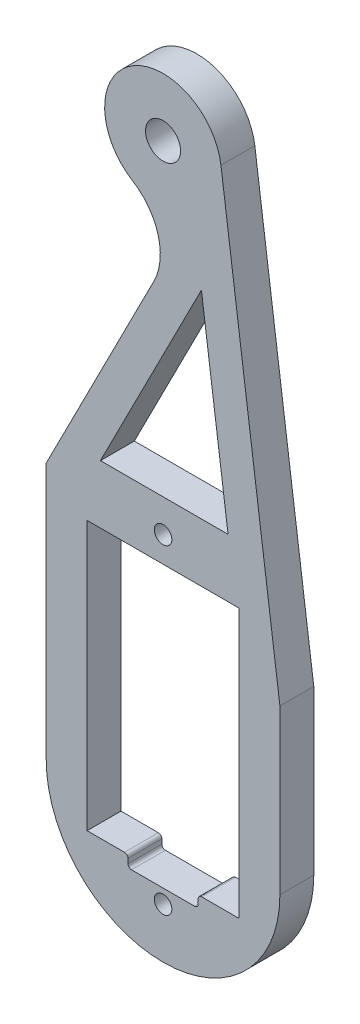
ISO-10303-21;
HEADER;
FILE_DESCRIPTION(('STEP AP214'),'2;1');
FILE_NAME('part.step','',(''),(''),'','','');
FILE_SCHEMA(('AUTOMOTIVE_DESIGN { 1 0 10303 214 1 1 1 1 }'));
ENDSEC;
DATA;
#1=APPLICATION_CONTEXT('core data for automotive mechanical design processes');
#2=APPLICATION_PROTOCOL_DEFINITION('international standard','automotive_design',2000,#1);
#3=PRODUCT_CONTEXT('',#1,'mechanical');
#4=PRODUCT('Part','Part','',(#3));
#5=PRODUCT_RELATED_PRODUCT_CATEGORY('part','',(#4));
#6=PRODUCT_DEFINITION_FORMATION('','',#4);
#7=PRODUCT_DEFINITION_CONTEXT('part definition',#1,'design');
#8=PRODUCT_DEFINITION('design','',#6,#7);
#9=PRODUCT_DEFINITION_SHAPE('','',#8);
#10=(LENGTH_UNIT() NAMED_UNIT(*) SI_UNIT(.MILLI.,.METRE.));
#11=(NAMED_UNIT(*) PLANE_ANGLE_UNIT() SI_UNIT($,.RADIAN.));
#12=(NAMED_UNIT(*) SI_UNIT($,.STERADIAN.) SOLID_ANGLE_UNIT());
#13=UNCERTAINTY_MEASURE_WITH_UNIT(LENGTH_MEASURE(1.E-05),#10,'distance_accuracy_value','');
#14=(GEOMETRIC_REPRESENTATION_CONTEXT(3) GLOBAL_UNCERTAINTY_ASSIGNED_CONTEXT((#13)) GLOBAL_UNIT_ASSIGNED_CONTEXT((#10,
#11,#12)) REPRESENTATION_CONTEXT('',''));
#15=CARTESIAN_POINT('',(0.,0.,0.));
#16=DIRECTION('',(0.,0.,1.));
#17=DIRECTION('',(1.,0.,0.));
#18=AXIS2_PLACEMENT_3D('',#15,#16,#17);
#19=CARTESIAN_POINT('',(0.,-11.5,1.45));
#20=DIRECTION('',(0.,1.,0.));
#21=DIRECTION('',(0.,0.,1.));
#22=AXIS2_PLACEMENT_3D('',#19,#20,#21);
#23=PLANE('',#22);
#24=DIRECTION('',(1.,0.,0.));
#25=VECTOR('',#24,1.);
#26=CARTESIAN_POINT('',(0.,-11.5,-1.45));
#27=LINE('',#26,#25);
#28=CARTESIAN_POINT('',(3.3,-11.5,-1.45));
#29=VERTEX_POINT('',#28);
#30=CARTESIAN_POINT('',(6.5,-11.5,-1.45));
#31=VERTEX_POINT('',#30);
#32=EDGE_CURVE('E282',#29,#31,#27,.T.);
#33=ORIENTED_EDGE('',*,*,#32,.F.);
#34=DIRECTION('',(0.,0.,1.));
#35=VECTOR('',#34,1.);
#36=CARTESIAN_POINT('',(3.3,-11.5,1.45));
#37=LINE('',#36,#35);
#38=CARTESIAN_POINT('',(3.3,-11.5,1.45));
#39=VERTEX_POINT('',#38);
#40=EDGE_CURVE('E349',#29,#39,#37,.T.);
#41=ORIENTED_EDGE('',*,*,#40,.T.);
#42=DIRECTION('',(1.,0.,0.));
#43=VECTOR('',#42,1.);
#44=CARTESIAN_POINT('',(0.,-11.5,1.45));
#45=LINE('',#44,#43);
#46=CARTESIAN_POINT('',(6.5,-11.5,1.45));
#47=VERTEX_POINT('',#46);
#48=EDGE_CURVE('E232',#39,#47,#45,.T.);
#49=ORIENTED_EDGE('',*,*,#48,.T.);
#50=DIRECTION('',(0.,0.,-1.));
#51=VECTOR('',#50,1.);
#52=CARTESIAN_POINT('',(6.5,-11.5,1.45));
#53=LINE('',#52,#51);
#54=EDGE_CURVE('E314',#47,#31,#53,.T.);
#55=ORIENTED_EDGE('',*,*,#54,.T.);
#56=EDGE_LOOP('',(#33,#41,#49,#55));
#57=FACE_BOUND('',#56,.T.);
#58=ADVANCED_FACE('F36',(#57),#23,.T.);
#59=CARTESIAN_POINT('',(0.,16.5,1.45));
#60=DIRECTION('',(0.,1.,0.));
#61=DIRECTION('',(0.,0.,1.));
#62=AXIS2_PLACEMENT_3D('',#59,#60,#61);
#63=PLANE('',#62);
#64=DIRECTION('',(1.,0.,0.));
#65=VECTOR('',#64,1.);
#66=CARTESIAN_POINT('',(0.,16.5,-1.45));
#67=LINE('',#66,#65);
#68=CARTESIAN_POINT('',(-5.35920766336086,16.5,-1.45));
#69=VERTEX_POINT('',#68);
#70=CARTESIAN_POINT('',(5.56229891618006,16.5,-1.45));
#71=VERTEX_POINT('',#70);
#72=EDGE_CURVE('E288',#69,#71,#67,.T.);
#73=ORIENTED_EDGE('',*,*,#72,.F.);
#74=DIRECTION('',(0.,0.,-1.));
#75=VECTOR('',#74,1.);
#76=CARTESIAN_POINT('',(-5.35920766336086,16.5,1.45));
#77=LINE('',#76,#75);
#78=CARTESIAN_POINT('',(-5.35920766336086,16.5,1.45));
#79=VERTEX_POINT('',#78);
#80=EDGE_CURVE('E308',#79,#69,#77,.T.);
#81=ORIENTED_EDGE('',*,*,#80,.F.);
#82=DIRECTION('',(1.,0.,0.));
#83=VECTOR('',#82,1.);
#84=CARTESIAN_POINT('',(0.,16.5,1.45));
#85=LINE('',#84,#83);
#86=CARTESIAN_POINT('',(5.56229891618006,16.5,1.45));
#87=VERTEX_POINT('',#86);
#88=EDGE_CURVE('E239',#79,#87,#85,.T.);
#89=ORIENTED_EDGE('',*,*,#88,.T.);
#90=DIRECTION('',(0.,0.,-1.));
#91=VECTOR('',#90,1.);
#92=CARTESIAN_POINT('',(5.56229891618006,16.5,1.45));
#93=LINE('',#92,#91);
#94=EDGE_CURVE('E303',#87,#71,#93,.T.);
#95=ORIENTED_EDGE('',*,*,#94,.T.);
#96=EDGE_LOOP('',(#73,#81,#89,#95));
#97=FACE_BOUND('',#96,.T.);
#98=ADVANCED_FACE('F431',(#97),#63,.T.);
#99=CARTESIAN_POINT('',(-10.9290256495219,5.56861670660875,1.45));
#100=DIRECTION('',(-0.891006524188369,0.453990499739544,0.));
#101=DIRECTION('',(-0.453990499739545,-0.891006524188369,0.));
#102=AXIS2_PLACEMENT_3D('',#99,#100,#101);
#103=PLANE('',#102);
#104=DIRECTION('',(0.453990499739544,0.891006524188369,0.));
#105=VECTOR('',#104,1.);
#106=CARTESIAN_POINT('',(-10.9290256495219,5.56861670660875,-1.45));
#107=LINE('',#106,#105);
#108=CARTESIAN_POINT('',(3.28334616685816,33.4619669415817,-1.45));
#109=VERTEX_POINT('',#108);
#110=EDGE_CURVE('E291',#69,#109,#107,.T.);
#111=ORIENTED_EDGE('',*,*,#110,.T.);
#112=DIRECTION('',(0.,0.,-1.));
#113=VECTOR('',#112,1.);
#114=CARTESIAN_POINT('',(3.28334616685816,33.4619669415817,1.45));
#115=LINE('',#114,#113);
#116=CARTESIAN_POINT('',(3.28334616685816,33.4619669415817,1.45));
#117=VERTEX_POINT('',#116);
#118=EDGE_CURVE('E305',#117,#109,#115,.T.);
#119=ORIENTED_EDGE('',*,*,#118,.F.);
#120=DIRECTION('',(0.453990499739544,0.891006524188369,0.));
#121=VECTOR('',#120,1.);
#122=CARTESIAN_POINT('',(-10.9290256495219,5.56861670660875,1.45));
#123=LINE('',#122,#121);
#124=EDGE_CURVE('E242',#79,#117,#123,.T.);
#125=ORIENTED_EDGE('',*,*,#124,.F.);
#126=ORIENTED_EDGE('',*,*,#80,.T.);
#127=EDGE_LOOP('',(#111,#119,#125,#126));
#128=FACE_BOUND('',#127,.T.);
#129=ADVANCED_FACE('F424',(#128),#103,.F.);
#130=CARTESIAN_POINT('',(0.,11.5,1.45));
#131=DIRECTION('',(0.,1.,0.));
#132=DIRECTION('',(0.,0.,1.));
#133=AXIS2_PLACEMENT_3D('',#130,#131,#132);
#134=PLANE('',#133);
#135=DIRECTION('',(1.,0.,0.));
#136=VECTOR('',#135,1.);
#137=CARTESIAN_POINT('',(0.,11.5,-1.45));
#138=LINE('',#137,#136);
#139=CARTESIAN_POINT('',(-6.5,11.5,-1.45));
#140=VERTEX_POINT('',#139);
#141=CARTESIAN_POINT('',(6.5,11.5,-1.45));
#142=VERTEX_POINT('',#141);
#143=EDGE_CURVE('E276',#140,#142,#138,.T.);
#144=ORIENTED_EDGE('',*,*,#143,.T.);
#145=DIRECTION('',(0.,0.,-1.));
#146=VECTOR('',#145,1.);
#147=CARTESIAN_POINT('',(6.5,11.5,1.45));
#148=LINE('',#147,#146);
#149=CARTESIAN_POINT('',(6.5,11.5,1.45));
#150=VERTEX_POINT('',#149);
#151=EDGE_CURVE('E306',#150,#142,#148,.T.);
#152=ORIENTED_EDGE('',*,*,#151,.F.);
#153=DIRECTION('',(1.,0.,0.));
#154=VECTOR('',#153,1.);
#155=CARTESIAN_POINT('',(0.,11.5,1.45));
#156=LINE('',#155,#154);
#157=CARTESIAN_POINT('',(-6.5,11.5,1.45));
#158=VERTEX_POINT('',#157);
#159=EDGE_CURVE('E226',#158,#150,#156,.T.);
#160=ORIENTED_EDGE('',*,*,#159,.F.);
#161=DIRECTION('',(0.,0.,-1.));
#162=VECTOR('',#161,1.);
#163=CARTESIAN_POINT('',(-6.5,11.5,1.45));
#164=LINE('',#163,#162);
#165=EDGE_CURVE('E196',#158,#140,#164,.T.);
#166=ORIENTED_EDGE('',*,*,#165,.T.);
#167=EDGE_LOOP('',(#144,#152,#160,#166));
#168=FACE_BOUND('',#167,.T.);
#169=ADVANCED_FACE('F422',(#168),#134,.F.);
#170=CARTESIAN_POINT('',(6.5,0.,1.45));
#171=DIRECTION('',(1.,0.,0.));
#172=DIRECTION('',(0.,1.,0.));
#173=AXIS2_PLACEMENT_3D('',#170,#171,#172);
#174=PLANE('',#173);
#175=DIRECTION('',(0.,-1.,0.));
#176=VECTOR('',#175,1.);
#177=CARTESIAN_POINT('',(6.5,0.,-1.45));
#178=LINE('',#177,#176);
#179=EDGE_CURVE('E279',#142,#31,#178,.T.);
#180=ORIENTED_EDGE('',*,*,#179,.T.);
#181=ORIENTED_EDGE('',*,*,#54,.F.);
#182=DIRECTION('',(0.,-1.,0.));
#183=VECTOR('',#182,1.);
#184=CARTESIAN_POINT('',(6.5,0.,1.45));
#185=LINE('',#184,#183);
#186=EDGE_CURVE('E229',#150,#47,#185,.T.);
#187=ORIENTED_EDGE('',*,*,#186,.F.);
#188=ORIENTED_EDGE('',*,*,#151,.T.);
#189=EDGE_LOOP('',(#180,#181,#187,#188));
#190=FACE_BOUND('',#189,.T.);
#191=ADVANCED_FACE('F407',(#190),#174,.F.);
#192=CARTESIAN_POINT('',(-6.5,-11.5,1.45));
#193=VERTEX_POINT('',#192);
#194=CARTESIAN_POINT('',(-3.3,-11.5,1.45));
#195=VERTEX_POINT('',#194);
#196=EDGE_CURVE('E233',#193,#195,#45,.T.);
#197=ORIENTED_EDGE('',*,*,#196,.T.);
#198=DIRECTION('',(0.,0.,1.));
#199=VECTOR('',#198,1.);
#200=CARTESIAN_POINT('',(-3.3,-11.5,-1.45));
#201=LINE('',#200,#199);
#202=CARTESIAN_POINT('',(-3.3,-11.5,-1.45));
#203=VERTEX_POINT('',#202);
#204=EDGE_CURVE('E363',#195,#203,#201,.F.);
#205=ORIENTED_EDGE('',*,*,#204,.T.);
#206=CARTESIAN_POINT('',(-6.5,-11.5,-1.45));
#207=VERTEX_POINT('',#206);
#208=EDGE_CURVE('E283',#207,#203,#27,.T.);
#209=ORIENTED_EDGE('',*,*,#208,.F.);
#210=DIRECTION('',(0.,0.,-1.));
#211=VECTOR('',#210,1.);
#212=CARTESIAN_POINT('',(-6.5,-11.5,1.45));
#213=LINE('',#212,#211);
#214=EDGE_CURVE('E312',#193,#207,#213,.T.);
#215=ORIENTED_EDGE('',*,*,#214,.F.);
#216=EDGE_LOOP('',(#197,#205,#209,#215));
#217=FACE_BOUND('',#216,.T.);
#218=ADVANCED_FACE('F419',(#217),#23,.T.);
#219=CARTESIAN_POINT('',(-5.23715044284418,34.361064899941,1.45));
#220=DIRECTION('',(0.,0.,-1.));
#221=DIRECTION('',(-1.,0.,0.));
#222=AXIS2_PLACEMENT_3D('',#219,#220,#221);
#223=CYLINDRICAL_SURFACE('',#222,5.);
#224=CARTESIAN_POINT('',(-5.23715044284418,34.361064899941,-1.45));
#225=DIRECTION('',(0.,0.,1.));
#226=DIRECTION('',(1.,0.,0.));
#227=AXIS2_PLACEMENT_3D('',#224,#225,#226);
#228=CIRCLE('',#227,5.);
#229=CARTESIAN_POINT('',(-0.78211782190234,32.0911124012433,-1.45));
#230=VERTEX_POINT('',#229);
#231=CARTESIAN_POINT('',(-2.61857522142209,38.6205324499705,-1.45));
#232=VERTEX_POINT('',#231);
#233=EDGE_CURVE('E191',#230,#232,#228,.T.);
#234=ORIENTED_EDGE('',*,*,#233,.F.);
#235=DIRECTION('',(0.,0.,-1.));
#236=VECTOR('',#235,1.);
#237=CARTESIAN_POINT('',(-0.78211782190234,32.0911124012433,1.45));
#238=LINE('',#237,#236);
#239=CARTESIAN_POINT('',(-0.78211782190234,32.0911124012433,1.45));
#240=VERTEX_POINT('',#239);
#241=EDGE_CURVE('E186',#240,#230,#238,.T.);
#242=ORIENTED_EDGE('',*,*,#241,.F.);
#243=CARTESIAN_POINT('',(-5.23715044284418,34.361064899941,1.45));
#244=DIRECTION('',(0.,0.,1.));
#245=DIRECTION('',(1.,0.,0.));
#246=AXIS2_PLACEMENT_3D('',#243,#244,#245);
#247=CIRCLE('',#246,5.);
#248=CARTESIAN_POINT('',(-2.61857522142209,38.6205324499705,1.45));
#249=VERTEX_POINT('',#248);
#250=EDGE_CURVE('E189',#240,#249,#247,.T.);
#251=ORIENTED_EDGE('',*,*,#250,.T.);
#252=DIRECTION('',(0.,0.,-1.));
#253=VECTOR('',#252,1.);
#254=CARTESIAN_POINT('',(-2.61857522142209,38.6205324499705,1.45));
#255=LINE('',#254,#253);
#256=EDGE_CURVE('E253',#249,#232,#255,.T.);
#257=ORIENTED_EDGE('',*,*,#256,.T.);
#258=EDGE_LOOP('',(#234,#242,#251,#257));
#259=FACE_BOUND('',#258,.T.);
#260=ADVANCED_FACE('F188',(#259),#223,.F.);
#261=CARTESIAN_POINT('',(-13.602045222087,6.93058820582737,1.45));
#262=DIRECTION('',(-0.891006524188369,0.453990499739544,0.));
#263=DIRECTION('',(-0.453990499739544,-0.891006524188369,0.));
#264=AXIS2_PLACEMENT_3D('',#261,#262,#263);
#265=PLANE('',#264);
#266=DIRECTION('',(0.453990499739544,0.891006524188369,0.));
#267=VECTOR('',#266,1.);
#268=CARTESIAN_POINT('',(-13.602045222087,6.93058820582737,-1.45));
#269=LINE('',#268,#267);
#270=CARTESIAN_POINT('',(-10.,14.,-1.45));
#271=VERTEX_POINT('',#270);
#272=EDGE_CURVE('E259',#271,#230,#269,.T.);
#273=ORIENTED_EDGE('',*,*,#272,.F.);
#274=DIRECTION('',(0.,0.,-1.));
#275=VECTOR('',#274,1.);
#276=CARTESIAN_POINT('',(-10.,14.,1.45));
#277=LINE('',#276,#275);
#278=CARTESIAN_POINT('',(-10.,14.,1.45));
#279=VERTEX_POINT('',#278);
#280=EDGE_CURVE('E197',#279,#271,#277,.T.);
#281=ORIENTED_EDGE('',*,*,#280,.F.);
#282=DIRECTION('',(0.453990499739544,0.891006524188369,0.));
#283=VECTOR('',#282,1.);
#284=CARTESIAN_POINT('',(-13.602045222087,6.93058820582737,1.45));
#285=LINE('',#284,#283);
#286=EDGE_CURVE('E204',#279,#240,#285,.T.);
#287=ORIENTED_EDGE('',*,*,#286,.T.);
#288=ORIENTED_EDGE('',*,*,#241,.T.);
#289=EDGE_LOOP('',(#273,#281,#287,#288));
#290=FACE_BOUND('',#289,.T.);
#291=ADVANCED_FACE('F211',(#290),#265,.T.);
#292=CARTESIAN_POINT('',(-10.,0.,1.45));
#293=DIRECTION('',(-1.,0.,0.));
#294=DIRECTION('',(0.,-1.,0.));
#295=AXIS2_PLACEMENT_3D('',#292,#293,#294);
#296=PLANE('',#295);
#297=DIRECTION('',(0.,1.,0.));
#298=VECTOR('',#297,1.);
#299=CARTESIAN_POINT('',(-10.,0.,-1.45));
#300=LINE('',#299,#298);
#301=CARTESIAN_POINT('',(-10.,-8.,-1.45));
#302=VERTEX_POINT('',#301);
#303=EDGE_CURVE('E261',#302,#271,#300,.T.);
#304=ORIENTED_EDGE('',*,*,#303,.F.);
#305=DIRECTION('',(0.,0.,-1.));
#306=VECTOR('',#305,1.);
#307=CARTESIAN_POINT('',(-10.,-8.,1.45));
#308=LINE('',#307,#306);
#309=CARTESIAN_POINT('',(-10.,-8.,1.45));
#310=VERTEX_POINT('',#309);
#311=EDGE_CURVE('E329',#310,#302,#308,.T.);
#312=ORIENTED_EDGE('',*,*,#311,.F.);
#313=DIRECTION('',(0.,1.,0.));
#314=VECTOR('',#313,1.);
#315=CARTESIAN_POINT('',(-10.,0.,1.45));
#316=LINE('',#315,#314);
#317=EDGE_CURVE('E212',#310,#279,#316,.T.);
#318=ORIENTED_EDGE('',*,*,#317,.T.);
#319=ORIENTED_EDGE('',*,*,#280,.T.);
#320=EDGE_LOOP('',(#304,#312,#318,#319));
#321=FACE_BOUND('',#320,.T.);
#322=ADVANCED_FACE('F451',(#321),#296,.T.);
#323=CARTESIAN_POINT('',(0.,-8.,1.45));
#324=DIRECTION('',(0.,0.,-1.));
#325=DIRECTION('',(-1.,0.,0.));
#326=AXIS2_PLACEMENT_3D('',#323,#324,#325);
#327=CYLINDRICAL_SURFACE('',#326,10.);
#328=CARTESIAN_POINT('',(0.,-8.,-1.45));
#329=DIRECTION('',(0.,0.,1.));
#330=DIRECTION('',(1.,0.,0.));
#331=AXIS2_PLACEMENT_3D('',#328,#329,#330);
#332=CIRCLE('',#331,10.);
#333=CARTESIAN_POINT('',(10.,-8.,-1.45));
#334=VERTEX_POINT('',#333);
#335=EDGE_CURVE('E264',#302,#334,#332,.T.);
#336=ORIENTED_EDGE('',*,*,#335,.T.);
#337=DIRECTION('',(0.,0.,-1.));
#338=VECTOR('',#337,1.);
#339=CARTESIAN_POINT('',(10.,-8.,1.45));
#340=LINE('',#339,#338);
#341=CARTESIAN_POINT('',(10.,-8.,1.45));
#342=VERTEX_POINT('',#341);
#343=EDGE_CURVE('E326',#342,#334,#340,.T.);
#344=ORIENTED_EDGE('',*,*,#343,.F.);
#345=CARTESIAN_POINT('',(0.,-8.,1.45));
#346=DIRECTION('',(0.,0.,1.));
#347=DIRECTION('',(1.,0.,0.));
#348=AXIS2_PLACEMENT_3D('',#345,#346,#347);
#349=CIRCLE('',#348,10.);
#350=EDGE_CURVE('E214',#310,#342,#349,.T.);
#351=ORIENTED_EDGE('',*,*,#350,.F.);
#352=ORIENTED_EDGE('',*,*,#311,.T.);
#353=EDGE_LOOP('',(#336,#344,#351,#352));
#354=FACE_BOUND('',#353,.T.);
#355=ADVANCED_FACE('F607',(#354),#327,.T.);
#356=CARTESIAN_POINT('',(10.,0.,1.45));
#357=DIRECTION('',(-1.,0.,0.));
#358=DIRECTION('',(0.,-1.,0.));
#359=AXIS2_PLACEMENT_3D('',#356,#357,#358);
#360=PLANE('',#359);
#361=DIRECTION('',(0.,1.,0.));
#362=VECTOR('',#361,1.);
#363=CARTESIAN_POINT('',(10.,0.,-1.45));
#364=LINE('',#363,#362);
#365=CARTESIAN_POINT('',(10.,6.,-1.45));
#366=VERTEX_POINT('',#365);
#367=EDGE_CURVE('E267',#334,#366,#364,.T.);
#368=ORIENTED_EDGE('',*,*,#367,.T.);
#369=DIRECTION('',(0.,0.,-1.));
#370=VECTOR('',#369,1.);
#371=CARTESIAN_POINT('',(10.,6.,1.45));
#372=LINE('',#371,#370);
#373=CARTESIAN_POINT('',(10.,6.,1.45));
#374=VERTEX_POINT('',#373);
#375=EDGE_CURVE('E323',#374,#366,#372,.T.);
#376=ORIENTED_EDGE('',*,*,#375,.F.);
#377=DIRECTION('',(0.,1.,0.));
#378=VECTOR('',#377,1.);
#379=CARTESIAN_POINT('',(10.,0.,1.45));
#380=LINE('',#379,#378);
#381=EDGE_CURVE('E220',#342,#374,#380,.T.);
#382=ORIENTED_EDGE('',*,*,#381,.F.);
#383=ORIENTED_EDGE('',*,*,#343,.T.);
#384=EDGE_LOOP('',(#368,#376,#382,#383));
#385=FACE_BOUND('',#384,.T.);
#386=ADVANCED_FACE('F597',(#385),#360,.F.);
#387=CARTESIAN_POINT('',(10.6145294422461,1.42613242547147,1.45));
#388=DIRECTION('',(-0.991094537062106,-0.133160123932241,0.));
#389=DIRECTION('',(0.133160123932241,-0.991094537062106,0.));
#390=AXIS2_PLACEMENT_3D('',#387,#388,#389);
#391=PLANE('',#390);
#392=DIRECTION('',(-0.133160123932241,0.991094537062106,0.));
#393=VECTOR('',#392,1.);
#394=CARTESIAN_POINT('',(10.6145294422461,1.42613242547147,-1.45));
#395=LINE('',#394,#393);
#396=CARTESIAN_POINT('',(4.95547268531053,43.5458006196612,-1.45));
#397=VERTEX_POINT('',#396);
#398=EDGE_CURVE('E270',#366,#397,#395,.T.);
#399=ORIENTED_EDGE('',*,*,#398,.T.);
#400=DIRECTION('',(0.,0.,-1.));
#401=VECTOR('',#400,1.);
#402=CARTESIAN_POINT('',(4.95547268531053,43.5458006196612,1.45));
#403=LINE('',#402,#401);
#404=CARTESIAN_POINT('',(4.95547268531053,43.5458006196612,1.45));
#405=VERTEX_POINT('',#404);
#406=EDGE_CURVE('E320',#405,#397,#403,.T.);
#407=ORIENTED_EDGE('',*,*,#406,.F.);
#408=DIRECTION('',(-0.133160123932241,0.991094537062106,0.));
#409=VECTOR('',#408,1.);
#410=CARTESIAN_POINT('',(10.6145294422461,1.42613242547147,1.45));
#411=LINE('',#410,#409);
#412=EDGE_CURVE('E223',#374,#405,#411,.T.);
#413=ORIENTED_EDGE('',*,*,#412,.F.);
#414=ORIENTED_EDGE('',*,*,#375,.T.);
#415=EDGE_LOOP('',(#399,#407,#413,#414));
#416=FACE_BOUND('',#415,.T.);
#417=ADVANCED_FACE('F587',(#416),#391,.F.);
#418=CARTESIAN_POINT('',(0.,13.7,1.45));
#419=DIRECTION('',(0.,0.,-1.));
#420=DIRECTION('',(-1.,0.,0.));
#421=AXIS2_PLACEMENT_3D('',#418,#419,#420);
#422=CYLINDRICAL_SURFACE('',#421,0.75);
#423=CARTESIAN_POINT('',(0.,13.7,1.45));
#424=DIRECTION('',(0.,0.,1.));
#425=DIRECTION('',(1.,0.,0.));
#426=AXIS2_PLACEMENT_3D('',#423,#424,#425);
#427=CIRCLE('',#426,0.75);
#428=CARTESIAN_POINT('',(0.75,13.7,1.45));
#429=VERTEX_POINT('',#428);
#430=EDGE_CURVE('E247',#429,#429,#427,.T.);
#431=ORIENTED_EDGE('',*,*,#430,.T.);
#432=EDGE_LOOP('',(#431));
#433=FACE_BOUND('',#432,.T.);
#434=CARTESIAN_POINT('',(0.,13.7,-1.45));
#435=DIRECTION('',(0.,0.,1.));
#436=DIRECTION('',(1.,0.,0.));
#437=AXIS2_PLACEMENT_3D('',#434,#435,#436);
#438=CIRCLE('',#437,0.75);
#439=CARTESIAN_POINT('',(0.75,13.7,-1.45));
#440=VERTEX_POINT('',#439);
#441=EDGE_CURVE('E297',#440,#440,#438,.T.);
#442=ORIENTED_EDGE('',*,*,#441,.F.);
#443=EDGE_LOOP('',(#442));
#444=FACE_BOUND('',#443,.T.);
#445=ADVANCED_FACE('F577',(#433,#444),#422,.F.);
#446=CARTESIAN_POINT('',(7.64124583105973,1.02665205367475,1.45));
#447=DIRECTION('',(-0.991094537062106,-0.133160123932241,0.));
#448=DIRECTION('',(0.133160123932241,-0.991094537062106,0.));
#449=AXIS2_PLACEMENT_3D('',#446,#447,#448);
#450=PLANE('',#449);
#451=DIRECTION('',(-0.133160123932241,0.991094537062106,0.));
#452=VECTOR('',#451,1.);
#453=CARTESIAN_POINT('',(7.64124583105973,1.02665205367475,-1.45));
#454=LINE('',#453,#452);
#455=EDGE_CURVE('E294',#71,#109,#454,.T.);
#456=ORIENTED_EDGE('',*,*,#455,.F.);
#457=ORIENTED_EDGE('',*,*,#94,.F.);
#458=DIRECTION('',(-0.133160123932241,0.991094537062106,0.));
#459=VECTOR('',#458,1.);
#460=CARTESIAN_POINT('',(7.64124583105973,1.02665205367475,1.45));
#461=LINE('',#460,#459);
#462=EDGE_CURVE('E244',#87,#117,#461,.T.);
#463=ORIENTED_EDGE('',*,*,#462,.T.);
#464=ORIENTED_EDGE('',*,*,#118,.T.);
#465=EDGE_LOOP('',(#456,#457,#463,#464));
#466=FACE_BOUND('',#465,.T.);
#467=ADVANCED_FACE('F569',(#466),#450,.T.);
#468=CARTESIAN_POINT('',(-6.5,0.,1.45));
#469=DIRECTION('',(1.,0.,0.));
#470=DIRECTION('',(0.,1.,0.));
#471=AXIS2_PLACEMENT_3D('',#468,#469,#470);
#472=PLANE('',#471);
#473=DIRECTION('',(0.,-1.,0.));
#474=VECTOR('',#473,1.);
#475=CARTESIAN_POINT('',(-6.5,0.,-1.45));
#476=LINE('',#475,#474);
#477=EDGE_CURVE('E285',#140,#207,#476,.T.);
#478=ORIENTED_EDGE('',*,*,#477,.F.);
#479=ORIENTED_EDGE('',*,*,#165,.F.);
#480=DIRECTION('',(0.,-1.,0.));
#481=VECTOR('',#480,1.);
#482=CARTESIAN_POINT('',(-6.5,0.,1.45));
#483=LINE('',#482,#481);
#484=EDGE_CURVE('E236',#158,#193,#483,.T.);
#485=ORIENTED_EDGE('',*,*,#484,.T.);
#486=ORIENTED_EDGE('',*,*,#214,.T.);
#487=EDGE_LOOP('',(#478,#479,#485,#486));
#488=FACE_BOUND('',#487,.T.);
#489=ADVANCED_FACE('F413',(#488),#472,.T.);
#490=CARTESIAN_POINT('',(0.,42.88,1.45));
#491=DIRECTION('',(0.,0.,-1.));
#492=DIRECTION('',(-1.,0.,0.));
#493=AXIS2_PLACEMENT_3D('',#490,#491,#492);
#494=CYLINDRICAL_SURFACE('',#493,5.);
#495=CARTESIAN_POINT('',(0.,42.88,-1.45));
#496=DIRECTION('',(0.,0.,1.));
#497=DIRECTION('',(1.,0.,0.));
#498=AXIS2_PLACEMENT_3D('',#495,#496,#497);
#499=CIRCLE('',#498,5.);
#500=EDGE_CURVE('E273',#397,#232,#499,.T.);
#501=ORIENTED_EDGE('',*,*,#500,.T.);
#502=ORIENTED_EDGE('',*,*,#256,.F.);
#503=CARTESIAN_POINT('',(0.,42.88,1.45));
#504=DIRECTION('',(0.,0.,1.));
#505=DIRECTION('',(1.,0.,0.));
#506=AXIS2_PLACEMENT_3D('',#503,#504,#505);
#507=CIRCLE('',#506,5.);
#508=EDGE_CURVE('E207',#405,#249,#507,.T.);
#509=ORIENTED_EDGE('',*,*,#508,.F.);
#510=ORIENTED_EDGE('',*,*,#406,.T.);
#511=EDGE_LOOP('',(#501,#502,#509,#510));
#512=FACE_BOUND('',#511,.T.);
#513=ADVANCED_FACE('F459',(#512),#494,.T.);
#514=CARTESIAN_POINT('',(0.,42.88,1.45));
#515=DIRECTION('',(0.,0.,-1.));
#516=DIRECTION('',(-1.,0.,0.));
#517=AXIS2_PLACEMENT_3D('',#514,#515,#516);
#518=CYLINDRICAL_SURFACE('',#517,1.5);
#519=CARTESIAN_POINT('',(0.,42.88,1.45));
#520=DIRECTION('',(0.,0.,1.));
#521=DIRECTION('',(1.,0.,0.));
#522=AXIS2_PLACEMENT_3D('',#519,#520,#521);
#523=CIRCLE('',#522,1.5);
#524=CARTESIAN_POINT('',(1.5,42.88,1.45));
#525=VERTEX_POINT('',#524);
#526=EDGE_CURVE('E209',#525,#525,#523,.T.);
#527=ORIENTED_EDGE('',*,*,#526,.T.);
#528=EDGE_LOOP('',(#527));
#529=FACE_BOUND('',#528,.T.);
#530=CARTESIAN_POINT('',(0.,42.88,-1.45));
#531=DIRECTION('',(0.,0.,1.));
#532=DIRECTION('',(1.,0.,0.));
#533=AXIS2_PLACEMENT_3D('',#530,#531,#532);
#534=CIRCLE('',#533,1.5);
#535=CARTESIAN_POINT('',(1.5,42.88,-1.45));
#536=VERTEX_POINT('',#535);
#537=EDGE_CURVE('E254',#536,#536,#534,.T.);
#538=ORIENTED_EDGE('',*,*,#537,.F.);
#539=EDGE_LOOP('',(#538));
#540=FACE_BOUND('',#539,.T.);
#541=ADVANCED_FACE('F455',(#529,#540),#518,.F.);
#542=CARTESIAN_POINT('',(0.,-13.7,1.45));
#543=DIRECTION('',(0.,0.,-1.));
#544=DIRECTION('',(-1.,0.,0.));
#545=AXIS2_PLACEMENT_3D('',#542,#543,#544);
#546=CYLINDRICAL_SURFACE('',#545,0.75);
#547=CARTESIAN_POINT('',(0.,-13.7,1.45));
#548=DIRECTION('',(0.,0.,1.));
#549=DIRECTION('',(1.,0.,0.));
#550=AXIS2_PLACEMENT_3D('',#547,#548,#549);
#551=CIRCLE('',#550,0.75);
#552=CARTESIAN_POINT('',(0.75,-13.7,1.45));
#553=VERTEX_POINT('',#552);
#554=EDGE_CURVE('E250',#553,#553,#551,.F.);
#555=ORIENTED_EDGE('',*,*,#554,.F.);
#556=EDGE_LOOP('',(#555));
#557=FACE_BOUND('',#556,.T.);
#558=CARTESIAN_POINT('',(0.,-13.7,-1.45));
#559=DIRECTION('',(0.,0.,1.));
#560=DIRECTION('',(1.,0.,0.));
#561=AXIS2_PLACEMENT_3D('',#558,#559,#560);
#562=CIRCLE('',#561,0.75);
#563=CARTESIAN_POINT('',(0.75,-13.7,-1.45));
#564=VERTEX_POINT('',#563);
#565=EDGE_CURVE('E300',#564,#564,#562,.F.);
#566=ORIENTED_EDGE('',*,*,#565,.T.);
#567=EDGE_LOOP('',(#566));
#568=FACE_BOUND('',#567,.T.);
#569=ADVANCED_FACE('F458',(#557,#568),#546,.F.);
#570=CARTESIAN_POINT('',(0.,0.,1.45));
#571=DIRECTION('',(0.,0.,1.));
#572=DIRECTION('',(1.,0.,0.));
#573=AXIS2_PLACEMENT_3D('',#570,#571,#572);
#574=PLANE('',#573);
#575=ORIENTED_EDGE('',*,*,#48,.F.);
#576=CARTESIAN_POINT('',(3.3,-11.8,1.45));
#577=DIRECTION('',(0.,0.,1.));
#578=DIRECTION('',(1.,0.,0.));
#579=AXIS2_PLACEMENT_3D('',#576,#577,#578);
#580=CIRCLE('',#579,0.3);
#581=CARTESIAN_POINT('',(3.,-11.8,1.45));
#582=VERTEX_POINT('',#581);
#583=EDGE_CURVE('E354',#39,#582,#580,.T.);
#584=ORIENTED_EDGE('',*,*,#583,.T.);
#585=DIRECTION('',(0.,1.,0.));
#586=VECTOR('',#585,1.);
#587=CARTESIAN_POINT('',(3.,-12.5,1.45));
#588=LINE('',#587,#586);
#589=CARTESIAN_POINT('',(3.,-12.2,1.45));
#590=VERTEX_POINT('',#589);
#591=EDGE_CURVE('E257',#590,#582,#588,.T.);
#592=ORIENTED_EDGE('',*,*,#591,.F.);
#593=CARTESIAN_POINT('',(2.7,-12.2,1.45));
#594=DIRECTION('',(0.,0.,1.));
#595=DIRECTION('',(1.,0.,0.));
#596=AXIS2_PLACEMENT_3D('',#593,#594,#595);
#597=CIRCLE('',#596,0.3);
#598=CARTESIAN_POINT('',(2.7,-12.5,1.45));
#599=VERTEX_POINT('',#598);
#600=EDGE_CURVE('E365',#590,#599,#597,.F.);
#601=ORIENTED_EDGE('',*,*,#600,.T.);
#602=DIRECTION('',(1.,0.,0.));
#603=VECTOR('',#602,1.);
#604=CARTESIAN_POINT('',(-3.,-12.5,1.45));
#605=LINE('',#604,#603);
#606=CARTESIAN_POINT('',(-2.7,-12.5,1.45));
#607=VERTEX_POINT('',#606);
#608=EDGE_CURVE('E375',#607,#599,#605,.T.);
#609=ORIENTED_EDGE('',*,*,#608,.F.);
#610=CARTESIAN_POINT('',(-2.7,-12.2,1.45));
#611=DIRECTION('',(0.,0.,1.));
#612=DIRECTION('',(1.,0.,0.));
#613=AXIS2_PLACEMENT_3D('',#610,#611,#612);
#614=CIRCLE('',#613,0.3);
#615=CARTESIAN_POINT('',(-3.,-12.2,1.45));
#616=VERTEX_POINT('',#615);
#617=EDGE_CURVE('E44',#607,#616,#614,.F.);
#618=ORIENTED_EDGE('',*,*,#617,.T.);
#619=DIRECTION('',(0.,-1.,0.));
#620=VECTOR('',#619,1.);
#621=CARTESIAN_POINT('',(-3.,-11.5,1.45));
#622=LINE('',#621,#620);
#623=CARTESIAN_POINT('',(-3.,-11.8,1.45));
#624=VERTEX_POINT('',#623);
#625=EDGE_CURVE('E373',#624,#616,#622,.T.);
#626=ORIENTED_EDGE('',*,*,#625,.F.);
#627=CARTESIAN_POINT('',(-3.3,-11.8,1.45));
#628=DIRECTION('',(0.,0.,1.));
#629=DIRECTION('',(1.,0.,0.));
#630=AXIS2_PLACEMENT_3D('',#627,#628,#629);
#631=CIRCLE('',#630,0.3);
#632=EDGE_CURVE('E352',#624,#195,#631,.T.);
#633=ORIENTED_EDGE('',*,*,#632,.T.);
#634=ORIENTED_EDGE('',*,*,#196,.F.);
#635=ORIENTED_EDGE('',*,*,#484,.F.);
#636=ORIENTED_EDGE('',*,*,#159,.T.);
#637=ORIENTED_EDGE('',*,*,#186,.T.);
#638=EDGE_LOOP('',(#575,#584,#592,#601,#609,#618,#626,#633,#634,#635,#636,#637));
#639=FACE_BOUND('',#638,.T.);
#640=ORIENTED_EDGE('',*,*,#526,.F.);
#641=EDGE_LOOP('',(#640));
#642=FACE_BOUND('',#641,.T.);
#643=ORIENTED_EDGE('',*,*,#250,.F.);
#644=ORIENTED_EDGE('',*,*,#286,.F.);
#645=ORIENTED_EDGE('',*,*,#317,.F.);
#646=ORIENTED_EDGE('',*,*,#350,.T.);
#647=ORIENTED_EDGE('',*,*,#381,.T.);
#648=ORIENTED_EDGE('',*,*,#412,.T.);
#649=ORIENTED_EDGE('',*,*,#508,.T.);
#650=EDGE_LOOP('',(#643,#644,#645,#646,#647,#648,#649));
#651=FACE_BOUND('',#650,.T.);
#652=ORIENTED_EDGE('',*,*,#88,.F.);
#653=ORIENTED_EDGE('',*,*,#124,.T.);
#654=ORIENTED_EDGE('',*,*,#462,.F.);
#655=EDGE_LOOP('',(#652,#653,#654));
#656=FACE_BOUND('',#655,.T.);
#657=ORIENTED_EDGE('',*,*,#430,.F.);
#658=EDGE_LOOP('',(#657));
#659=FACE_BOUND('',#658,.T.);
#660=ORIENTED_EDGE('',*,*,#554,.T.);
#661=EDGE_LOOP('',(#660));
#662=FACE_BOUND('',#661,.T.);
#663=ADVANCED_FACE('F201',(#639,#642,#651,#656,#659,#662),#574,.T.);
#664=CARTESIAN_POINT('',(0.,0.,-1.45));
#665=DIRECTION('',(0.,0.,1.));
#666=DIRECTION('',(1.,0.,0.));
#667=AXIS2_PLACEMENT_3D('',#664,#665,#666);
#668=PLANE('',#667);
#669=ORIENTED_EDGE('',*,*,#537,.T.);
#670=EDGE_LOOP('',(#669));
#671=FACE_BOUND('',#670,.T.);
#672=ORIENTED_EDGE('',*,*,#233,.T.);
#673=ORIENTED_EDGE('',*,*,#500,.F.);
#674=ORIENTED_EDGE('',*,*,#398,.F.);
#675=ORIENTED_EDGE('',*,*,#367,.F.);
#676=ORIENTED_EDGE('',*,*,#335,.F.);
#677=ORIENTED_EDGE('',*,*,#303,.T.);
#678=ORIENTED_EDGE('',*,*,#272,.T.);
#679=EDGE_LOOP('',(#672,#673,#674,#675,#676,#677,#678));
#680=FACE_BOUND('',#679,.T.);
#681=DIRECTION('',(0.,1.,0.));
#682=VECTOR('',#681,1.);
#683=CARTESIAN_POINT('',(3.,0.,-1.45));
#684=LINE('',#683,#682);
#685=CARTESIAN_POINT('',(3.,-12.2,-1.45));
#686=VERTEX_POINT('',#685);
#687=CARTESIAN_POINT('',(3.,-11.8,-1.45));
#688=VERTEX_POINT('',#687);
#689=EDGE_CURVE('E336',#686,#688,#684,.T.);
#690=ORIENTED_EDGE('',*,*,#689,.T.);
#691=CARTESIAN_POINT('',(3.3,-11.8,-1.45));
#692=DIRECTION('',(0.,0.,1.));
#693=DIRECTION('',(1.,0.,0.));
#694=AXIS2_PLACEMENT_3D('',#691,#692,#693);
#695=CIRCLE('',#694,0.3);
#696=EDGE_CURVE('E357',#688,#29,#695,.F.);
#697=ORIENTED_EDGE('',*,*,#696,.T.);
#698=ORIENTED_EDGE('',*,*,#32,.T.);
#699=ORIENTED_EDGE('',*,*,#179,.F.);
#700=ORIENTED_EDGE('',*,*,#143,.F.);
#701=ORIENTED_EDGE('',*,*,#477,.T.);
#702=ORIENTED_EDGE('',*,*,#208,.T.);
#703=CARTESIAN_POINT('',(-3.3,-11.8,-1.45));
#704=DIRECTION('',(0.,0.,1.));
#705=DIRECTION('',(1.,0.,0.));
#706=AXIS2_PLACEMENT_3D('',#703,#704,#705);
#707=CIRCLE('',#706,0.3);
#708=CARTESIAN_POINT('',(-3.,-11.8,-1.45));
#709=VERTEX_POINT('',#708);
#710=EDGE_CURVE('E58',#203,#709,#707,.F.);
#711=ORIENTED_EDGE('',*,*,#710,.T.);
#712=DIRECTION('',(0.,-1.,0.));
#713=VECTOR('',#712,1.);
#714=CARTESIAN_POINT('',(-3.,0.,-1.45));
#715=LINE('',#714,#713);
#716=CARTESIAN_POINT('',(-3.,-12.2,-1.45));
#717=VERTEX_POINT('',#716);
#718=EDGE_CURVE('E310',#709,#717,#715,.T.);
#719=ORIENTED_EDGE('',*,*,#718,.T.);
#720=CARTESIAN_POINT('',(-2.7,-12.2,-1.45));
#721=DIRECTION('',(0.,0.,1.));
#722=DIRECTION('',(1.,0.,0.));
#723=AXIS2_PLACEMENT_3D('',#720,#721,#722);
#724=CIRCLE('',#723,0.3);
#725=CARTESIAN_POINT('',(-2.7,-12.5,-1.45));
#726=VERTEX_POINT('',#725);
#727=EDGE_CURVE('E11',#717,#726,#724,.T.);
#728=ORIENTED_EDGE('',*,*,#727,.T.);
#729=DIRECTION('',(1.,0.,0.));
#730=VECTOR('',#729,1.);
#731=CARTESIAN_POINT('',(0.,-12.5,-1.45));
#732=LINE('',#731,#730);
#733=CARTESIAN_POINT('',(2.7,-12.5,-1.45));
#734=VERTEX_POINT('',#733);
#735=EDGE_CURVE('E333',#726,#734,#732,.T.);
#736=ORIENTED_EDGE('',*,*,#735,.T.);
#737=CARTESIAN_POINT('',(2.7,-12.2,-1.45));
#738=DIRECTION('',(0.,0.,1.));
#739=DIRECTION('',(1.,0.,0.));
#740=AXIS2_PLACEMENT_3D('',#737,#738,#739);
#741=CIRCLE('',#740,0.3);
#742=EDGE_CURVE('E367',#734,#686,#741,.T.);
#743=ORIENTED_EDGE('',*,*,#742,.T.);
#744=EDGE_LOOP('',(#690,#697,#698,#699,#700,#701,#702,#711,#719,#728,#736,#743));
#745=FACE_BOUND('',#744,.T.);
#746=ORIENTED_EDGE('',*,*,#72,.T.);
#747=ORIENTED_EDGE('',*,*,#455,.T.);
#748=ORIENTED_EDGE('',*,*,#110,.F.);
#749=EDGE_LOOP('',(#746,#747,#748));
#750=FACE_BOUND('',#749,.T.);
#751=ORIENTED_EDGE('',*,*,#441,.T.);
#752=EDGE_LOOP('',(#751));
#753=FACE_BOUND('',#752,.T.);
#754=ORIENTED_EDGE('',*,*,#565,.F.);
#755=EDGE_LOOP('',(#754));
#756=FACE_BOUND('',#755,.T.);
#757=ADVANCED_FACE('F384',(#671,#680,#745,#750,#753,#756),#668,.F.);
#758=CARTESIAN_POINT('',(3.,-12.5,-1.55));
#759=DIRECTION('',(1.,0.,0.));
#760=DIRECTION('',(0.,0.,-1.));
#761=AXIS2_PLACEMENT_3D('',#758,#759,#760);
#762=PLANE('',#761);
#763=ORIENTED_EDGE('',*,*,#689,.F.);
#764=DIRECTION('',(0.,0.,1.));
#765=VECTOR('',#764,1.);
#766=CARTESIAN_POINT('',(3.,-12.2,1.45));
#767=LINE('',#766,#765);
#768=EDGE_CURVE('E341',#686,#590,#767,.T.);
#769=ORIENTED_EDGE('',*,*,#768,.T.);
#770=ORIENTED_EDGE('',*,*,#591,.T.);
#771=DIRECTION('',(0.,0.,1.));
#772=VECTOR('',#771,1.);
#773=CARTESIAN_POINT('',(3.,-11.8,-1.45));
#774=LINE('',#773,#772);
#775=EDGE_CURVE('E339',#582,#688,#774,.F.);
#776=ORIENTED_EDGE('',*,*,#775,.T.);
#777=EDGE_LOOP('',(#763,#769,#770,#776));
#778=FACE_BOUND('',#777,.T.);
#779=ADVANCED_FACE('F396',(#778),#762,.F.);
#780=CARTESIAN_POINT('',(-3.,-12.5,-1.55));
#781=DIRECTION('',(0.,-1.,0.));
#782=DIRECTION('',(0.,0.,-1.));
#783=AXIS2_PLACEMENT_3D('',#780,#781,#782);
#784=PLANE('',#783);
#785=ORIENTED_EDGE('',*,*,#608,.T.);
#786=DIRECTION('',(0.,0.,1.));
#787=VECTOR('',#786,1.);
#788=CARTESIAN_POINT('',(2.7,-12.5,-1.45));
#789=LINE('',#788,#787);
#790=EDGE_CURVE('E347',#599,#734,#789,.F.);
#791=ORIENTED_EDGE('',*,*,#790,.T.);
#792=ORIENTED_EDGE('',*,*,#735,.F.);
#793=DIRECTION('',(0.,0.,1.));
#794=VECTOR('',#793,1.);
#795=CARTESIAN_POINT('',(-2.7,-12.5,1.45));
#796=LINE('',#795,#794);
#797=EDGE_CURVE('E344',#726,#607,#796,.T.);
#798=ORIENTED_EDGE('',*,*,#797,.T.);
#799=EDGE_LOOP('',(#785,#791,#792,#798));
#800=FACE_BOUND('',#799,.T.);
#801=ADVANCED_FACE('F388',(#800),#784,.F.);
#802=CARTESIAN_POINT('',(-3.,-11.5,-1.55));
#803=DIRECTION('',(-1.,0.,0.));
#804=DIRECTION('',(0.,0.,1.));
#805=AXIS2_PLACEMENT_3D('',#802,#803,#804);
#806=PLANE('',#805);
#807=ORIENTED_EDGE('',*,*,#625,.T.);
#808=DIRECTION('',(0.,0.,1.));
#809=VECTOR('',#808,1.);
#810=CARTESIAN_POINT('',(-3.,-12.2,-1.45));
#811=LINE('',#810,#809);
#812=EDGE_CURVE('E51',#616,#717,#811,.F.);
#813=ORIENTED_EDGE('',*,*,#812,.T.);
#814=ORIENTED_EDGE('',*,*,#718,.F.);
#815=DIRECTION('',(0.,0.,1.));
#816=VECTOR('',#815,1.);
#817=CARTESIAN_POINT('',(-3.,-11.8,1.45));
#818=LINE('',#817,#816);
#819=EDGE_CURVE('E359',#709,#624,#818,.T.);
#820=ORIENTED_EDGE('',*,*,#819,.T.);
#821=EDGE_LOOP('',(#807,#813,#814,#820));
#822=FACE_BOUND('',#821,.T.);
#823=ADVANCED_FACE('F378',(#822),#806,.F.);
#824=CARTESIAN_POINT('',(2.7,-12.2,-1.55));
#825=DIRECTION('',(0.,0.,-1.));
#826=DIRECTION('',(-1.,0.,0.));
#827=AXIS2_PLACEMENT_3D('',#824,#825,#826);
#828=CYLINDRICAL_SURFACE('',#827,0.3);
#829=ORIENTED_EDGE('',*,*,#742,.F.);
#830=ORIENTED_EDGE('',*,*,#790,.F.);
#831=ORIENTED_EDGE('',*,*,#600,.F.);
#832=ORIENTED_EDGE('',*,*,#768,.F.);
#833=EDGE_LOOP('',(#829,#830,#831,#832));
#834=FACE_BOUND('',#833,.T.);
#835=ADVANCED_FACE('F391',(#834),#828,.F.);
#836=CARTESIAN_POINT('',(3.3,-11.8,1.45));
#837=DIRECTION('',(0.,0.,-1.));
#838=DIRECTION('',(-1.,0.,0.));
#839=AXIS2_PLACEMENT_3D('',#836,#837,#838);
#840=CYLINDRICAL_SURFACE('',#839,0.3);
#841=ORIENTED_EDGE('',*,*,#696,.F.);
#842=ORIENTED_EDGE('',*,*,#775,.F.);
#843=ORIENTED_EDGE('',*,*,#583,.F.);
#844=ORIENTED_EDGE('',*,*,#40,.F.);
#845=EDGE_LOOP('',(#841,#842,#843,#844));
#846=FACE_BOUND('',#845,.T.);
#847=ADVANCED_FACE('F401',(#846),#840,.T.);
#848=CARTESIAN_POINT('',(-2.7,-12.2,-1.55));
#849=DIRECTION('',(0.,0.,-1.));
#850=DIRECTION('',(-1.,0.,0.));
#851=AXIS2_PLACEMENT_3D('',#848,#849,#850);
#852=CYLINDRICAL_SURFACE('',#851,0.3);
#853=ORIENTED_EDGE('',*,*,#727,.F.);
#854=ORIENTED_EDGE('',*,*,#812,.F.);
#855=ORIENTED_EDGE('',*,*,#617,.F.);
#856=ORIENTED_EDGE('',*,*,#797,.F.);
#857=EDGE_LOOP('',(#853,#854,#855,#856));
#858=FACE_BOUND('',#857,.T.);
#859=ADVANCED_FACE('F382',(#858),#852,.F.);
#860=CARTESIAN_POINT('',(-3.3,-11.8,-1.55));
#861=DIRECTION('',(0.,0.,-1.));
#862=DIRECTION('',(-1.,0.,0.));
#863=AXIS2_PLACEMENT_3D('',#860,#861,#862);
#864=CYLINDRICAL_SURFACE('',#863,0.3);
#865=ORIENTED_EDGE('',*,*,#710,.F.);
#866=ORIENTED_EDGE('',*,*,#204,.F.);
#867=ORIENTED_EDGE('',*,*,#632,.F.);
#868=ORIENTED_EDGE('',*,*,#819,.F.);
#869=EDGE_LOOP('',(#865,#866,#867,#868));
#870=FACE_BOUND('',#869,.T.);
#871=ADVANCED_FACE('F38',(#870),#864,.T.);
#872=CLOSED_SHELL('',(#58,#98,#129,#169,#191,#218,#260,#291,#322,#355,#386,#417,#445,#467,#489,
#513,#541,#569,#663,#757,#779,#801,#823,#835,#847,#859,#871));
#873=MANIFOLD_SOLID_BREP('B2',#872);
#874=ADVANCED_BREP_SHAPE_REPRESENTATION('',(#18,#873),#14);
#875=SHAPE_DEFINITION_REPRESENTATION(#9,#874);
ENDSEC;
END-ISO-10303-21;
